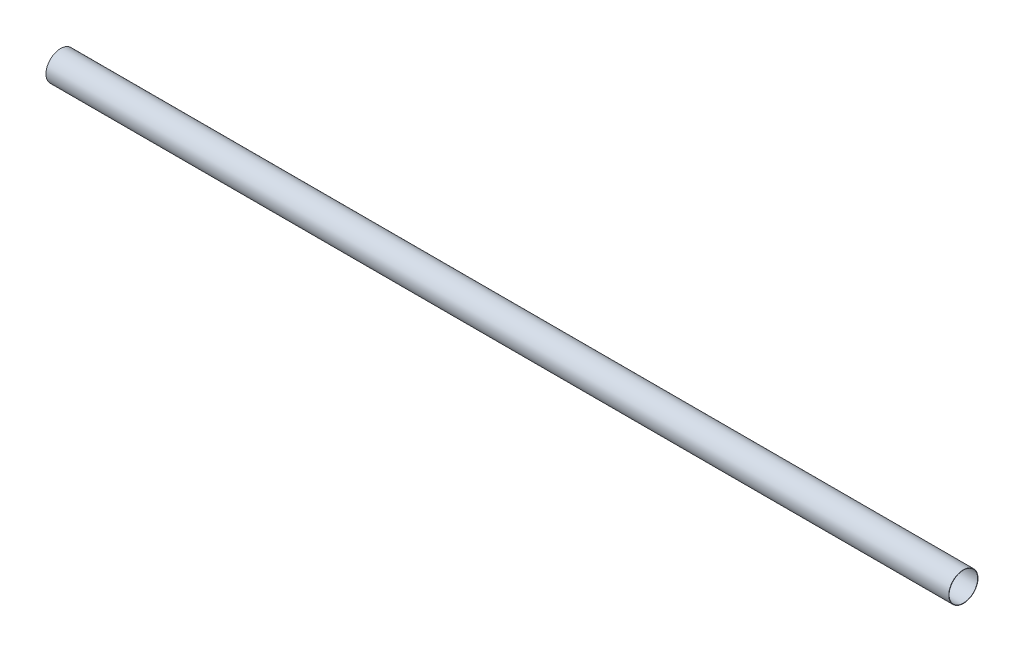
ISO-10303-21;
HEADER;
FILE_DESCRIPTION(('STEP AP214'),'2;1');
FILE_NAME('part.step','',(''),(''),'','','');
FILE_SCHEMA(('AUTOMOTIVE_DESIGN { 1 0 10303 214 1 1 1 1 }'));
ENDSEC;
DATA;
#1=APPLICATION_CONTEXT('core data for automotive mechanical design processes');
#2=APPLICATION_PROTOCOL_DEFINITION('international standard','automotive_design',2000,#1);
#3=PRODUCT_CONTEXT('',#1,'mechanical');
#4=PRODUCT('Part','Part','',(#3));
#5=PRODUCT_RELATED_PRODUCT_CATEGORY('part','',(#4));
#6=PRODUCT_DEFINITION_FORMATION('','',#4);
#7=PRODUCT_DEFINITION_CONTEXT('part definition',#1,'design');
#8=PRODUCT_DEFINITION('design','',#6,#7);
#9=PRODUCT_DEFINITION_SHAPE('','',#8);
#10=(LENGTH_UNIT() NAMED_UNIT(*) SI_UNIT(.MILLI.,.METRE.));
#11=(NAMED_UNIT(*) PLANE_ANGLE_UNIT() SI_UNIT($,.RADIAN.));
#12=(NAMED_UNIT(*) SI_UNIT($,.STERADIAN.) SOLID_ANGLE_UNIT());
#13=UNCERTAINTY_MEASURE_WITH_UNIT(LENGTH_MEASURE(1.E-05),#10,'distance_accuracy_value','');
#14=(GEOMETRIC_REPRESENTATION_CONTEXT(3) GLOBAL_UNCERTAINTY_ASSIGNED_CONTEXT((#13)) GLOBAL_UNIT_ASSIGNED_CONTEXT((#10,
#11,#12)) REPRESENTATION_CONTEXT('',''));
#15=CARTESIAN_POINT('',(0.,0.,0.));
#16=DIRECTION('',(0.,0.,1.));
#17=DIRECTION('',(1.,0.,0.));
#18=AXIS2_PLACEMENT_3D('',#15,#16,#17);
#19=CARTESIAN_POINT('',(2500.,0.,0.));
#20=DIRECTION('',(1.,0.,0.));
#21=DIRECTION('',(0.,0.,-1.));
#22=AXIS2_PLACEMENT_3D('',#19,#20,#21);
#23=PLANE('',#22);
#24=CARTESIAN_POINT('',(2500.,0.,0.));
#25=DIRECTION('',(1.,0.,0.));
#26=DIRECTION('',(0.,0.,-1.));
#27=AXIS2_PLACEMENT_3D('',#24,#25,#26);
#28=CIRCLE('',#27,40.5);
#29=CARTESIAN_POINT('',(2500.,0.,-40.5));
#30=VERTEX_POINT('',#29);
#31=EDGE_CURVE('E10',#30,#30,#28,.T.);
#32=ORIENTED_EDGE('',*,*,#31,.T.);
#33=EDGE_LOOP('',(#32));
#34=FACE_BOUND('',#33,.T.);
#35=CARTESIAN_POINT('',(2500.,0.,0.));
#36=DIRECTION('',(1.,0.,0.));
#37=DIRECTION('',(0.,0.,-1.));
#38=AXIS2_PLACEMENT_3D('',#35,#36,#37);
#39=CIRCLE('',#38,39.5);
#40=CARTESIAN_POINT('',(2500.,0.,-39.5));
#41=VERTEX_POINT('',#40);
#42=EDGE_CURVE('E50',#41,#41,#39,.T.);
#43=ORIENTED_EDGE('',*,*,#42,.F.);
#44=EDGE_LOOP('',(#43));
#45=FACE_BOUND('',#44,.T.);
#46=ADVANCED_FACE('F37',(#34,#45),#23,.T.);
#47=CARTESIAN_POINT('',(0.,0.,0.));
#48=DIRECTION('',(1.,0.,0.));
#49=DIRECTION('',(0.,0.,-1.));
#50=AXIS2_PLACEMENT_3D('',#47,#48,#49);
#51=PLANE('',#50);
#52=CARTESIAN_POINT('',(0.,0.,0.));
#53=DIRECTION('',(1.,0.,0.));
#54=DIRECTION('',(0.,0.,-1.));
#55=AXIS2_PLACEMENT_3D('',#52,#53,#54);
#56=CIRCLE('',#55,40.5);
#57=CARTESIAN_POINT('',(0.,0.,-40.5));
#58=VERTEX_POINT('',#57);
#59=EDGE_CURVE('E41',#58,#58,#56,.T.);
#60=ORIENTED_EDGE('',*,*,#59,.F.);
#61=EDGE_LOOP('',(#60));
#62=FACE_BOUND('',#61,.T.);
#63=CARTESIAN_POINT('',(0.,0.,0.));
#64=DIRECTION('',(1.,0.,0.));
#65=DIRECTION('',(0.,0.,-1.));
#66=AXIS2_PLACEMENT_3D('',#63,#64,#65);
#67=CIRCLE('',#66,39.5);
#68=CARTESIAN_POINT('',(0.,0.,-39.5));
#69=VERTEX_POINT('',#68);
#70=EDGE_CURVE('E52',#69,#69,#67,.T.);
#71=ORIENTED_EDGE('',*,*,#70,.T.);
#72=EDGE_LOOP('',(#71));
#73=FACE_BOUND('',#72,.T.);
#74=ADVANCED_FACE('F64',(#62,#73),#51,.F.);
#75=CARTESIAN_POINT('',(2500.,0.,0.));
#76=DIRECTION('',(-1.,0.,0.));
#77=DIRECTION('',(0.,0.,1.));
#78=AXIS2_PLACEMENT_3D('',#75,#76,#77);
#79=CYLINDRICAL_SURFACE('',#78,40.5);
#80=ORIENTED_EDGE('',*,*,#31,.F.);
#81=EDGE_LOOP('',(#80));
#82=FACE_BOUND('',#81,.T.);
#83=ORIENTED_EDGE('',*,*,#59,.T.);
#84=EDGE_LOOP('',(#83));
#85=FACE_BOUND('',#84,.T.);
#86=ADVANCED_FACE('F39',(#82,#85),#79,.T.);
#87=CARTESIAN_POINT('',(2500.,0.,0.));
#88=DIRECTION('',(-1.,0.,0.));
#89=DIRECTION('',(0.,0.,1.));
#90=AXIS2_PLACEMENT_3D('',#87,#88,#89);
#91=CYLINDRICAL_SURFACE('',#90,39.5);
#92=ORIENTED_EDGE('',*,*,#42,.T.);
#93=EDGE_LOOP('',(#92));
#94=FACE_BOUND('',#93,.T.);
#95=ORIENTED_EDGE('',*,*,#70,.F.);
#96=EDGE_LOOP('',(#95));
#97=FACE_BOUND('',#96,.T.);
#98=ADVANCED_FACE('F60',(#94,#97),#91,.F.);
#99=CLOSED_SHELL('',(#46,#74,#86,#98));
#100=MANIFOLD_SOLID_BREP('B2',#99);
#101=ADVANCED_BREP_SHAPE_REPRESENTATION('',(#18,#100),#14);
#102=SHAPE_DEFINITION_REPRESENTATION(#9,#101);
ENDSEC;
END-ISO-10303-21;
